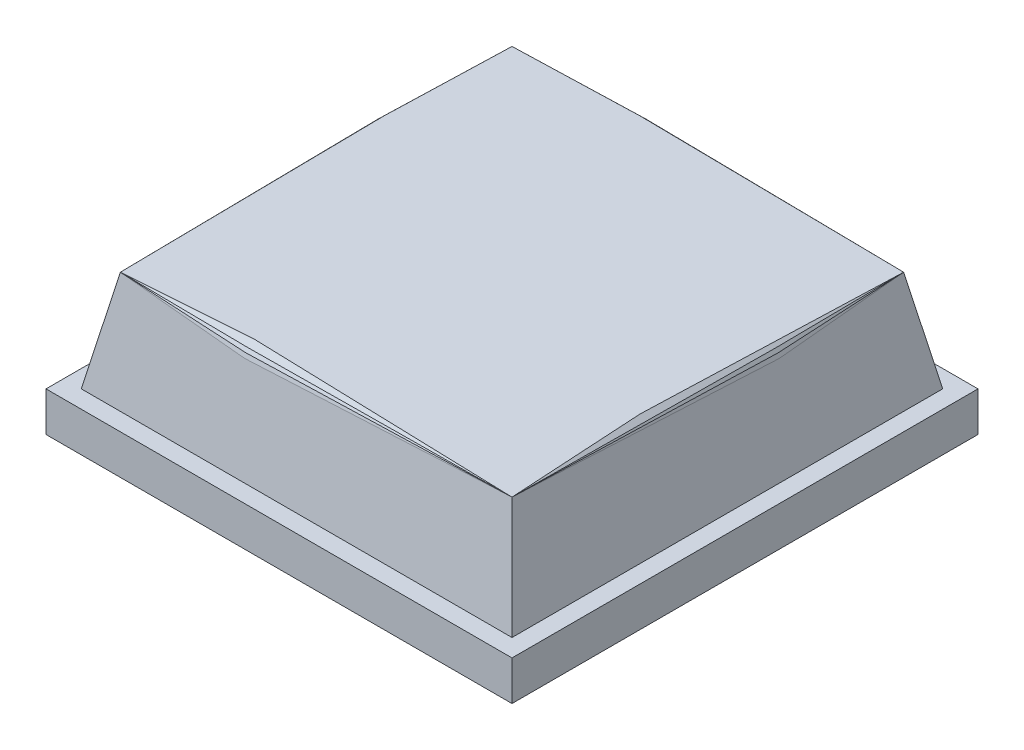
ISO-10303-21;
HEADER;
FILE_DESCRIPTION(('STEP AP214'),'2;1');
FILE_NAME('part.step','',(''),(''),'','','');
FILE_SCHEMA(('AUTOMOTIVE_DESIGN { 1 0 10303 214 1 1 1 1 }'));
ENDSEC;
DATA;
#1=APPLICATION_CONTEXT('core data for automotive mechanical design processes');
#2=APPLICATION_PROTOCOL_DEFINITION('international standard','automotive_design',2000,#1);
#3=PRODUCT_CONTEXT('',#1,'mechanical');
#4=PRODUCT('Part','Part','',(#3));
#5=PRODUCT_RELATED_PRODUCT_CATEGORY('part','',(#4));
#6=PRODUCT_DEFINITION_FORMATION('','',#4);
#7=PRODUCT_DEFINITION_CONTEXT('part definition',#1,'design');
#8=PRODUCT_DEFINITION('design','',#6,#7);
#9=PRODUCT_DEFINITION_SHAPE('','',#8);
#10=(LENGTH_UNIT() NAMED_UNIT(*) SI_UNIT(.MILLI.,.METRE.));
#11=(NAMED_UNIT(*) PLANE_ANGLE_UNIT() SI_UNIT($,.RADIAN.));
#12=(NAMED_UNIT(*) SI_UNIT($,.STERADIAN.) SOLID_ANGLE_UNIT());
#13=UNCERTAINTY_MEASURE_WITH_UNIT(LENGTH_MEASURE(1.E-05),#10,'distance_accuracy_value','');
#14=(GEOMETRIC_REPRESENTATION_CONTEXT(3) GLOBAL_UNCERTAINTY_ASSIGNED_CONTEXT((#13)) GLOBAL_UNIT_ASSIGNED_CONTEXT((#10,
#11,#12)) REPRESENTATION_CONTEXT('',''));
#15=CARTESIAN_POINT('',(0.,0.,0.));
#16=DIRECTION('',(0.,0.,1.));
#17=DIRECTION('',(1.,0.,0.));
#18=AXIS2_PLACEMENT_3D('',#15,#16,#17);
#19=CARTESIAN_POINT('',(-1.322304010391,0.900009989738,-1.322298049927));
#20=DIRECTION('',(0.,-1.,0.));
#21=DIRECTION('',(0.,0.,-1.));
#22=AXIS2_PLACEMENT_3D('',#19,#20,#21);
#23=PLANE('',#22);
#24=DIRECTION('',(1.,0.,0.));
#25=VECTOR('',#24,1.);
#26=CARTESIAN_POINT('',(-1.322304010391,0.900009989738,1.36746145053088));
#27=LINE('',#26,#25);
#28=CARTESIAN_POINT('',(-1.38684975132917,0.855441931824092,1.38679408885828));
#29=VERTEX_POINT('',#28);
#30=CARTESIAN_POINT('',(1.38195648174537,0.858002736950883,1.3819585083034));
#31=VERTEX_POINT('',#30);
#32=EDGE_CURVE('E139',#29,#31,#27,.T.);
#33=ORIENTED_EDGE('',*,*,#32,.T.);
#34=DIRECTION('',(0.,0.,-1.));
#35=VECTOR('',#34,1.);
#36=CARTESIAN_POINT('',(1.36745942397288,0.900009989738,1.322249054909));
#37=LINE('',#36,#35);
#38=CARTESIAN_POINT('',(1.38679205942356,0.855441938343511,-1.38684374729613));
#39=VERTEX_POINT('',#38);
#40=EDGE_CURVE('E143',#31,#39,#37,.T.);
#41=ORIENTED_EDGE('',*,*,#40,.T.);
#42=DIRECTION('',(1.,0.,0.));
#43=VECTOR('',#42,1.);
#44=CARTESIAN_POINT('',(1.322247028351,0.900009989738,-1.36751127495713));
#45=LINE('',#44,#43);
#46=CARTESIAN_POINT('',(-1.38201398596581,0.858002826587039,-1.38200798734529));
#47=VERTEX_POINT('',#46);
#48=EDGE_CURVE('E129',#47,#39,#45,.T.);
#49=ORIENTED_EDGE('',*,*,#48,.F.);
#50=DIRECTION('',(0.,0.,1.));
#51=VECTOR('',#50,1.);
#52=CARTESIAN_POINT('',(-1.36751723542201,0.900009989738,-1.322298049927));
#53=LINE('',#52,#51);
#54=EDGE_CURVE('E126',#47,#29,#53,.T.);
#55=ORIENTED_EDGE('',*,*,#54,.T.);
#56=EDGE_LOOP('',(#33,#41,#49,#55));
#57=FACE_BOUND('',#56,.T.);
#58=ADVANCED_FACE('F17',(#57),#23,.F.);
#59=CARTESIAN_POINT('',(-1.386971950531,0.881332993507,-1.386965990067));
#60=DIRECTION('',(0.692540892128907,-0.721378619539904,0.));
#61=DIRECTION('',(0.721378619539904,0.692540892128907,0.));
#62=AXIS2_PLACEMENT_3D('',#59,#60,#61);
#63=PLANE('',#62);
#64=DIRECTION('',(0.,0.,1.));
#65=VECTOR('',#64,1.);
#66=CARTESIAN_POINT('',(-1.40563499927527,0.863416016102158,0.01156492549872));
#67=LINE('',#66,#65);
#68=EDGE_CURVE('E112',#47,#29,#67,.T.);
#69=ORIENTED_EDGE('',*,*,#68,.T.);
#70=ORIENTED_EDGE('',*,*,#54,.F.);
#71=EDGE_LOOP('',(#69,#70));
#72=FACE_BOUND('',#71,.T.);
#73=ADVANCED_FACE('F124',(#72),#63,.F.);
#74=CARTESIAN_POINT('',(-1.386971950531,0.881332993507,1.386916041374));
#75=DIRECTION('',(0.,-0.72137640958305,-0.692543194102048));
#76=DIRECTION('',(0.,0.692543194102048,-0.72137640958305));
#77=AXIS2_PLACEMENT_3D('',#74,#75,#76);
#78=PLANE('',#77);
#79=DIRECTION('',(1.,0.,0.));
#80=VECTOR('',#79,1.);
#81=CARTESIAN_POINT('',(0.01156094541689,0.863416016101707,1.4055789709085));
#82=LINE('',#81,#80);
#83=EDGE_CURVE('E128',#29,#31,#82,.T.);
#84=ORIENTED_EDGE('',*,*,#83,.T.);
#85=ORIENTED_EDGE('',*,*,#32,.F.);
#86=EDGE_LOOP('',(#84,#85));
#87=FACE_BOUND('',#86,.T.);
#88=ADVANCED_FACE('F140',(#87),#78,.F.);
#89=CARTESIAN_POINT('',(1.400900153844,0.867905876587,0.003254344412202));
#90=DIRECTION('',(0.692543194102048,0.72137640958305,0.));
#91=DIRECTION('',(-0.72137640958305,0.692543194102048,0.));
#92=AXIS2_PLACEMENT_3D('',#89,#90,#91);
#93=PLANE('',#92);
#94=DIRECTION('',(0.,0.,1.));
#95=VECTOR('',#94,1.);
#96=CARTESIAN_POINT('',(1.40557694435103,0.863416016102019,-0.01161496344334));
#97=LINE('',#96,#95);
#98=EDGE_CURVE('E136',#39,#31,#97,.T.);
#99=ORIENTED_EDGE('',*,*,#98,.F.);
#100=ORIENTED_EDGE('',*,*,#40,.F.);
#101=EDGE_LOOP('',(#99,#100));
#102=FACE_BOUND('',#101,.T.);
#103=ADVANCED_FACE('F418',(#102),#93,.T.);
#104=CARTESIAN_POINT('',(0.003250368179617,0.867905876627,-1.400952218388));
#105=DIRECTION('',(0.,0.721378619539904,-0.692540892128907));
#106=DIRECTION('',(0.,0.692540892128907,0.721378619539904));
#107=AXIS2_PLACEMENT_3D('',#104,#105,#106);
#108=PLANE('',#107);
#109=DIRECTION('',(1.,0.,0.));
#110=VECTOR('',#109,1.);
#111=CARTESIAN_POINT('',(-0.01161894362515,0.863416016102001,-1.405629038811));
#112=LINE('',#111,#110);
#113=EDGE_CURVE('E115',#39,#47,#112,.F.);
#114=ORIENTED_EDGE('',*,*,#113,.T.);
#115=ORIENTED_EDGE('',*,*,#48,.T.);
#116=EDGE_LOOP('',(#114,#115));
#117=FACE_BOUND('',#116,.T.);
#118=ADVANCED_FACE('F409',(#117),#108,.T.);
#119=CARTESIAN_POINT('',(-1.405634999275,0.863416016102,-1.405629038811));
#120=DIRECTION('',(0.860384417172621,-0.509645616763776,0.));
#121=DIRECTION('',(0.509645616763776,0.860384417172621,0.));
#122=AXIS2_PLACEMENT_3D('',#119,#120,#121);
#123=PLANE('',#122);
#124=DIRECTION('',(0.,0.,1.));
#125=VECTOR('',#124,1.);
#126=CARTESIAN_POINT('',(-1.4201569557191,0.838900029659029,1.428475022316));
#127=LINE('',#126,#125);
#128=EDGE_CURVE('E98',#47,#29,#127,.T.);
#129=ORIENTED_EDGE('',*,*,#128,.T.);
#130=ORIENTED_EDGE('',*,*,#68,.F.);
#131=EDGE_LOOP('',(#129,#130));
#132=FACE_BOUND('',#131,.T.);
#133=ADVANCED_FACE('F110',(#132),#123,.F.);
#134=CARTESIAN_POINT('',(-1.405634999275,0.863416016102,1.405578970909));
#135=DIRECTION('',(0.,-0.509648713733221,-0.860382582686373));
#136=DIRECTION('',(0.,0.860382582686373,-0.509648713733221));
#137=AXIS2_PLACEMENT_3D('',#134,#135,#136);
#138=PLANE('',#137);
#139=DIRECTION('',(1.,0.,0.));
#140=VECTOR('',#139,1.);
#141=CARTESIAN_POINT('',(0.01010403867814,0.838900029659013,1.42010104656205));
#142=LINE('',#141,#140);
#143=EDGE_CURVE('E114',#31,#29,#142,.F.);
#144=ORIENTED_EDGE('',*,*,#143,.F.);
#145=ORIENTED_EDGE('',*,*,#83,.F.);
#146=EDGE_LOOP('',(#144,#145));
#147=FACE_BOUND('',#146,.T.);
#148=ADVANCED_FACE('F133',(#147),#138,.F.);
#149=CARTESIAN_POINT('',(1.416457285391,0.845047960475,0.004303960654688));
#150=DIRECTION('',(0.860382582686373,0.509648713733221,0.));
#151=DIRECTION('',(-0.509648713733221,0.860382582686373,0.));
#152=AXIS2_PLACEMENT_3D('',#149,#150,#151);
#153=PLANE('',#152);
#154=DIRECTION('',(0.,0.,1.));
#155=VECTOR('',#154,1.);
#156=CARTESIAN_POINT('',(1.42009902000436,0.8389000296591,-1.428524971008));
#157=LINE('',#156,#155);
#158=EDGE_CURVE('E121',#31,#39,#157,.F.);
#159=ORIENTED_EDGE('',*,*,#158,.T.);
#160=ORIENTED_EDGE('',*,*,#98,.T.);
#161=EDGE_LOOP('',(#159,#160));
#162=FACE_BOUND('',#161,.T.);
#163=ADVANCED_FACE('F382',(#162),#153,.T.);
#164=CARTESIAN_POINT('',(0.004299953814113,0.84504796039,-1.416509290586));
#165=DIRECTION('',(0.,-0.509645616763776,0.860384417172621));
#166=DIRECTION('',(0.,-0.860384417172621,-0.509645616763776));
#167=AXIS2_PLACEMENT_3D('',#164,#165,#166);
#168=PLANE('',#167);
#169=DIRECTION('',(1.,0.,0.));
#170=VECTOR('',#169,1.);
#171=CARTESIAN_POINT('',(-0.01016201191649,0.83890002965894,-1.42015099525478));
#172=LINE('',#171,#170);
#173=EDGE_CURVE('E177',#39,#47,#172,.F.);
#174=ORIENTED_EDGE('',*,*,#173,.T.);
#175=ORIENTED_EDGE('',*,*,#113,.F.);
#176=EDGE_LOOP('',(#174,#175));
#177=FACE_BOUND('',#176,.T.);
#178=ADVANCED_FACE('F373',(#177),#168,.F.);
#179=CARTESIAN_POINT('',(-1.420156955719,0.838900029659,-1.420150995255));
#180=DIRECTION('',(0.963369349179908,-0.268178106974974,0.));
#181=DIRECTION('',(0.268178106974974,0.963369349179908,0.));
#182=AXIS2_PLACEMENT_3D('',#179,#180,#181);
#183=PLANE('',#182);
#184=DIRECTION('',(0.,0.,1.));
#185=VECTOR('',#184,1.);
#186=CARTESIAN_POINT('',(-1.42853105068208,0.808817982674011,-0.175717359814));
#187=LINE('',#186,#185);
#188=EDGE_CURVE('E87',#47,#29,#187,.T.);
#189=ORIENTED_EDGE('',*,*,#188,.T.);
#190=ORIENTED_EDGE('',*,*,#128,.F.);
#191=EDGE_LOOP('',(#189,#190));
#192=FACE_BOUND('',#191,.T.);
#193=ADVANCED_FACE('F96',(#192),#183,.F.);
#194=CARTESIAN_POINT('',(-0.005975024037807,0.816370114777,1.426372726181));
#195=DIRECTION('',(0.,0.268174563888085,0.963370335480305));
#196=DIRECTION('',(0.,-0.963370335480305,0.268174563888085));
#197=AXIS2_PLACEMENT_3D('',#194,#195,#196);
#198=PLANE('',#197);
#199=DIRECTION('',(1.,0.,0.));
#200=VECTOR('',#199,1.);
#201=CARTESIAN_POINT('',(-0.175721406951,0.808817982674032,1.42847502231623));
#202=LINE('',#201,#200);
#203=EDGE_CURVE('E92',#29,#31,#202,.T.);
#204=ORIENTED_EDGE('',*,*,#203,.T.);
#205=ORIENTED_EDGE('',*,*,#143,.T.);
#206=EDGE_LOOP('',(#204,#205));
#207=FACE_BOUND('',#206,.T.);
#208=ADVANCED_FACE('F117',(#207),#198,.T.);
#209=CARTESIAN_POINT('',(1.426370699578,0.816370114937,0.005921044253369));
#210=DIRECTION('',(0.963370335480305,0.268174563888085,0.));
#211=DIRECTION('',(-0.268174563888085,0.963370335480305,0.));
#212=AXIS2_PLACEMENT_3D('',#209,#210,#211);
#213=PLANE('',#212);
#214=DIRECTION('',(0.,0.,1.));
#215=VECTOR('',#214,1.);
#216=CARTESIAN_POINT('',(1.42847299575836,0.808817982674051,0.175667414386));
#217=LINE('',#216,#215);
#218=EDGE_CURVE('E160',#31,#39,#217,.F.);
#219=ORIENTED_EDGE('',*,*,#218,.T.);
#220=ORIENTED_EDGE('',*,*,#158,.F.);
#221=EDGE_LOOP('',(#219,#220));
#222=FACE_BOUND('',#221,.T.);
#223=ADVANCED_FACE('F346',(#222),#213,.T.);
#224=CARTESIAN_POINT('',(1.420099020004,0.838900029659,-1.420150995255));
#225=DIRECTION('',(0.,-0.268174563888085,0.963370335480305));
#226=DIRECTION('',(0.,-0.963370335480305,-0.268174563888085));
#227=AXIS2_PLACEMENT_3D('',#224,#225,#226);
#228=PLANE('',#227);
#229=DIRECTION('',(1.,0.,0.));
#230=VECTOR('',#229,1.);
#231=CARTESIAN_POINT('',(0.175663386793,0.80881798267403,-1.42852497100821));
#232=LINE('',#231,#230);
#233=EDGE_CURVE('E173',#39,#47,#232,.F.);
#234=ORIENTED_EDGE('',*,*,#233,.T.);
#235=ORIENTED_EDGE('',*,*,#173,.F.);
#236=EDGE_LOOP('',(#234,#235));
#237=FACE_BOUND('',#236,.T.);
#238=ADVANCED_FACE('F337',(#237),#228,.F.);
#239=CARTESIAN_POINT('',(-1.498535511995,0.323583367551,0.127422398362));
#240=DIRECTION('',(0.989752869050483,-0.14279095982007,0.));
#241=DIRECTION('',(0.14279095982007,0.989752869050483,0.));
#242=AXIS2_PLACEMENT_3D('',#239,#240,#241);
#243=PLANE('',#242);
#244=DIRECTION('',(-0.141357144348653,-0.979814403910171,0.141357318988969));
#245=VECTOR('',#244,1.);
#246=CARTESIAN_POINT('',(-1.42853105068154,0.808817982673934,1.428475022316));
#247=LINE('',#246,#245);
#248=CARTESIAN_POINT('',(-1.52502095699291,0.140000000596016,1.5249650478362));
#249=VERTEX_POINT('',#248);
#250=EDGE_CURVE('E84',#29,#249,#247,.T.);
#251=ORIENTED_EDGE('',*,*,#250,.F.);
#252=ORIENTED_EDGE('',*,*,#188,.F.);
#253=DIRECTION('',(0.141357144348624,0.979814403909969,0.141357318990405));
#254=VECTOR('',#253,1.);
#255=CARTESIAN_POINT('',(-1.52502095699319,0.140000000596028,-1.525014996529));
#256=LINE('',#255,#254);
#257=CARTESIAN_POINT('',(-1.52502095699305,0.140000000595994,-1.52501499652891));
#258=VERTEX_POINT('',#257);
#259=EDGE_CURVE('E100',#258,#47,#256,.T.);
#260=ORIENTED_EDGE('',*,*,#259,.F.);
#261=DIRECTION('',(0.,0.,-1.));
#262=VECTOR('',#261,1.);
#263=CARTESIAN_POINT('',(-1.525020956993,0.140000000596,1.524965047836));
#264=LINE('',#263,#262);
#265=EDGE_CURVE('E90',#258,#249,#264,.F.);
#266=ORIENTED_EDGE('',*,*,#265,.T.);
#267=EDGE_LOOP('',(#251,#252,#260,#266));
#268=FACE_BOUND('',#267,.T.);
#269=ADVANCED_FACE('F86',(#268),#243,.F.);
#270=CARTESIAN_POINT('',(0.127418432887,0.323583346745,1.498479573119));
#271=DIRECTION('',(0.,0.14279113263494,0.989752844118586));
#272=DIRECTION('',(0.,-0.989752844118586,0.14279113263494));
#273=AXIS2_PLACEMENT_3D('',#270,#271,#272);
#274=PLANE('',#273);
#275=DIRECTION('',(-0.141357315499379,0.979814379721809,-0.141357315499324));
#276=VECTOR('',#275,1.);
#277=CARTESIAN_POINT('',(1.52496302127839,0.140000000596057,1.524965047836));
#278=LINE('',#277,#276);
#279=CARTESIAN_POINT('',(1.52496302127812,0.140000000596056,1.52496504783627));
#280=VERTEX_POINT('',#279);
#281=EDGE_CURVE('E78',#280,#31,#278,.T.);
#282=ORIENTED_EDGE('',*,*,#281,.T.);
#283=ORIENTED_EDGE('',*,*,#203,.F.);
#284=ORIENTED_EDGE('',*,*,#250,.T.);
#285=DIRECTION('',(1.,0.,0.));
#286=VECTOR('',#285,1.);
#287=CARTESIAN_POINT('',(1.524963021278,0.140000000596,1.524965047836));
#288=LINE('',#287,#286);
#289=EDGE_CURVE('E168',#249,#280,#288,.T.);
#290=ORIENTED_EDGE('',*,*,#289,.T.);
#291=EDGE_LOOP('',(#282,#283,#284,#290));
#292=FACE_BOUND('',#291,.T.);
#293=ADVANCED_FACE('F103',(#292),#274,.T.);
#294=CARTESIAN_POINT('',(1.498477543493,0.323583368012,-0.127472350318));
#295=DIRECTION('',(-0.989752844118586,-0.14279113263494,0.));
#296=DIRECTION('',(0.14279113263494,-0.989752844118586,0.));
#297=AXIS2_PLACEMENT_3D('',#294,#295,#296);
#298=PLANE('',#297);
#299=DIRECTION('',(0.14135731549935,-0.979814379721606,-0.14135731550076));
#300=VECTOR('',#299,1.);
#301=CARTESIAN_POINT('',(1.42847299575868,0.808817982674098,-1.428524971008));
#302=LINE('',#301,#300);
#303=CARTESIAN_POINT('',(1.52496302127818,0.14000000059596,-1.52501499652854));
#304=VERTEX_POINT('',#303);
#305=EDGE_CURVE('E165',#39,#304,#302,.T.);
#306=ORIENTED_EDGE('',*,*,#305,.F.);
#307=ORIENTED_EDGE('',*,*,#218,.F.);
#308=ORIENTED_EDGE('',*,*,#281,.F.);
#309=DIRECTION('',(0.,0.,-1.));
#310=VECTOR('',#309,1.);
#311=CARTESIAN_POINT('',(1.524963021278,0.140000000596,-1.525014996529));
#312=LINE('',#311,#310);
#313=EDGE_CURVE('E167',#280,#304,#312,.T.);
#314=ORIENTED_EDGE('',*,*,#313,.T.);
#315=EDGE_LOOP('',(#306,#307,#308,#314));
#316=FACE_BOUND('',#315,.T.);
#317=ADVANCED_FACE('F310',(#316),#298,.F.);
#318=CARTESIAN_POINT('',(-0.127476394942,0.323583348961,-1.498529521491));
#319=DIRECTION('',(0.,-0.14279113263494,0.989752844118586));
#320=DIRECTION('',(0.,-0.989752844118586,-0.14279113263494));
#321=AXIS2_PLACEMENT_3D('',#318,#319,#320);
#322=PLANE('',#321);
#323=ORIENTED_EDGE('',*,*,#259,.T.);
#324=ORIENTED_EDGE('',*,*,#233,.F.);
#325=ORIENTED_EDGE('',*,*,#305,.T.);
#326=DIRECTION('',(1.,0.,0.));
#327=VECTOR('',#326,1.);
#328=CARTESIAN_POINT('',(-1.525020956993,0.140000000596,-1.525014996529));
#329=LINE('',#328,#327);
#330=EDGE_CURVE('E209',#304,#258,#329,.F.);
#331=ORIENTED_EDGE('',*,*,#330,.T.);
#332=EDGE_LOOP('',(#323,#324,#325,#331));
#333=FACE_BOUND('',#332,.T.);
#334=ADVANCED_FACE('F300',(#333),#322,.F.);
#335=CARTESIAN_POINT('',(1.649999976158,0.140000000596,-1.649999976158));
#336=DIRECTION('',(0.,-1.,0.));
#337=DIRECTION('',(0.,0.,-1.));
#338=AXIS2_PLACEMENT_3D('',#335,#336,#337);
#339=PLANE('',#338);
#340=ORIENTED_EDGE('',*,*,#265,.F.);
#341=ORIENTED_EDGE('',*,*,#330,.F.);
#342=ORIENTED_EDGE('',*,*,#313,.F.);
#343=ORIENTED_EDGE('',*,*,#289,.F.);
#344=EDGE_LOOP('',(#340,#341,#342,#343));
#345=FACE_BOUND('',#344,.T.);
#346=DIRECTION('',(1.,0.,0.));
#347=VECTOR('',#346,1.);
#348=CARTESIAN_POINT('',(-1.649999976158,0.140000000596,-1.649999976158));
#349=LINE('',#348,#347);
#350=CARTESIAN_POINT('',(1.649999976158,0.140000000596,-1.649999976158));
#351=VERTEX_POINT('',#350);
#352=CARTESIAN_POINT('',(-1.649999976158,0.140000000596,-1.649999976158));
#353=VERTEX_POINT('',#352);
#354=EDGE_CURVE('E228',#351,#353,#349,.F.);
#355=ORIENTED_EDGE('',*,*,#354,.T.);
#356=DIRECTION('',(0.,0.,-1.));
#357=VECTOR('',#356,1.);
#358=CARTESIAN_POINT('',(-1.649999976158,0.140000000596,1.649999976158));
#359=LINE('',#358,#357);
#360=CARTESIAN_POINT('',(-1.649999976158,0.140000000596,1.649999976158));
#361=VERTEX_POINT('',#360);
#362=EDGE_CURVE('E215',#353,#361,#359,.F.);
#363=ORIENTED_EDGE('',*,*,#362,.T.);
#364=DIRECTION('',(-1.,0.,0.));
#365=VECTOR('',#364,1.);
#366=CARTESIAN_POINT('',(1.649999976158,0.140000000596,1.649999976158));
#367=LINE('',#366,#365);
#368=CARTESIAN_POINT('',(1.649999976158,0.140000000596,1.649999976158));
#369=VERTEX_POINT('',#368);
#370=EDGE_CURVE('E218',#361,#369,#367,.F.);
#371=ORIENTED_EDGE('',*,*,#370,.T.);
#372=DIRECTION('',(0.,0.,1.));
#373=VECTOR('',#372,1.);
#374=CARTESIAN_POINT('',(1.649999976158,0.140000000596,-1.649999976158));
#375=LINE('',#374,#373);
#376=EDGE_CURVE('E225',#369,#351,#375,.F.);
#377=ORIENTED_EDGE('',*,*,#376,.T.);
#378=EDGE_LOOP('',(#355,#363,#371,#377));
#379=FACE_BOUND('',#378,.T.);
#380=ADVANCED_FACE('F252',(#345,#379),#339,.F.);
#381=CARTESIAN_POINT('',(-1.649999976158,-0.140000000596,-1.649999976158));
#382=DIRECTION('',(1.,0.,0.));
#383=DIRECTION('',(0.,0.,-1.));
#384=AXIS2_PLACEMENT_3D('',#381,#382,#383);
#385=PLANE('',#384);
#386=DIRECTION('',(0.,1.,0.));
#387=VECTOR('',#386,1.);
#388=CARTESIAN_POINT('',(-1.649999976158,-0.140000000596,1.649999976158));
#389=LINE('',#388,#387);
#390=CARTESIAN_POINT('',(-1.649999976158,-0.140000000596,1.649999976158));
#391=VERTEX_POINT('',#390);
#392=EDGE_CURVE('E220',#361,#391,#389,.F.);
#393=ORIENTED_EDGE('',*,*,#392,.F.);
#394=ORIENTED_EDGE('',*,*,#362,.F.);
#395=DIRECTION('',(0.,1.,0.));
#396=VECTOR('',#395,1.);
#397=CARTESIAN_POINT('',(-1.649999976158,0.140000000596,-1.649999976158));
#398=LINE('',#397,#396);
#399=CARTESIAN_POINT('',(-1.649999976158,-0.140000000596,-1.649999976158));
#400=VERTEX_POINT('',#399);
#401=EDGE_CURVE('E212',#400,#353,#398,.T.);
#402=ORIENTED_EDGE('',*,*,#401,.F.);
#403=DIRECTION('',(0.,0.,1.));
#404=VECTOR('',#403,1.);
#405=CARTESIAN_POINT('',(-1.649999976158,-0.140000000596,1.649999976158));
#406=LINE('',#405,#404);
#407=EDGE_CURVE('E230',#400,#391,#406,.T.);
#408=ORIENTED_EDGE('',*,*,#407,.T.);
#409=EDGE_LOOP('',(#393,#394,#402,#408));
#410=FACE_BOUND('',#409,.T.);
#411=ADVANCED_FACE('F250',(#410),#385,.F.);
#412=CARTESIAN_POINT('',(-1.649999976158,-0.140000000596,1.649999976158));
#413=DIRECTION('',(0.,0.,-1.));
#414=DIRECTION('',(-1.,0.,0.));
#415=AXIS2_PLACEMENT_3D('',#412,#413,#414);
#416=PLANE('',#415);
#417=DIRECTION('',(0.,1.,0.));
#418=VECTOR('',#417,1.);
#419=CARTESIAN_POINT('',(1.649999976158,0.140000000596,1.649999976158));
#420=LINE('',#419,#418);
#421=CARTESIAN_POINT('',(1.649999976158,-0.140000000596,1.649999976158));
#422=VERTEX_POINT('',#421);
#423=EDGE_CURVE('E222',#422,#369,#420,.T.);
#424=ORIENTED_EDGE('',*,*,#423,.T.);
#425=ORIENTED_EDGE('',*,*,#370,.F.);
#426=ORIENTED_EDGE('',*,*,#392,.T.);
#427=DIRECTION('',(1.,0.,0.));
#428=VECTOR('',#427,1.);
#429=CARTESIAN_POINT('',(1.649999976158,-0.140000000596,1.649999976158));
#430=LINE('',#429,#428);
#431=EDGE_CURVE('E233',#391,#422,#430,.T.);
#432=ORIENTED_EDGE('',*,*,#431,.T.);
#433=EDGE_LOOP('',(#424,#425,#426,#432));
#434=FACE_BOUND('',#433,.T.);
#435=ADVANCED_FACE('F254',(#434),#416,.F.);
#436=CARTESIAN_POINT('',(1.649999976158,-0.140000000596,1.649999976158));
#437=DIRECTION('',(-1.,0.,0.));
#438=DIRECTION('',(0.,0.,1.));
#439=AXIS2_PLACEMENT_3D('',#436,#437,#438);
#440=PLANE('',#439);
#441=DIRECTION('',(0.,1.,0.));
#442=VECTOR('',#441,1.);
#443=CARTESIAN_POINT('',(1.649999976158,-0.140000000596,-1.649999976158));
#444=LINE('',#443,#442);
#445=CARTESIAN_POINT('',(1.649999976158,-0.140000000596,-1.649999976158));
#446=VERTEX_POINT('',#445);
#447=EDGE_CURVE('E34',#351,#446,#444,.F.);
#448=ORIENTED_EDGE('',*,*,#447,.F.);
#449=ORIENTED_EDGE('',*,*,#376,.F.);
#450=ORIENTED_EDGE('',*,*,#423,.F.);
#451=DIRECTION('',(0.,0.,1.));
#452=VECTOR('',#451,1.);
#453=CARTESIAN_POINT('',(1.649999976158,-0.140000000596,-1.649999976158));
#454=LINE('',#453,#452);
#455=EDGE_CURVE('E26',#422,#446,#454,.F.);
#456=ORIENTED_EDGE('',*,*,#455,.T.);
#457=EDGE_LOOP('',(#448,#449,#450,#456));
#458=FACE_BOUND('',#457,.T.);
#459=ADVANCED_FACE('F240',(#458),#440,.F.);
#460=CARTESIAN_POINT('',(1.649999976158,-0.140000000596,-1.649999976158));
#461=DIRECTION('',(0.,0.,1.));
#462=DIRECTION('',(1.,0.,0.));
#463=AXIS2_PLACEMENT_3D('',#460,#461,#462);
#464=PLANE('',#463);
#465=ORIENTED_EDGE('',*,*,#401,.T.);
#466=ORIENTED_EDGE('',*,*,#354,.F.);
#467=ORIENTED_EDGE('',*,*,#447,.T.);
#468=DIRECTION('',(1.,0.,0.));
#469=VECTOR('',#468,1.);
#470=CARTESIAN_POINT('',(-1.649999976158,-0.140000000596,-1.649999976158));
#471=LINE('',#470,#469);
#472=EDGE_CURVE('E11',#446,#400,#471,.F.);
#473=ORIENTED_EDGE('',*,*,#472,.T.);
#474=EDGE_LOOP('',(#465,#466,#467,#473));
#475=FACE_BOUND('',#474,.T.);
#476=ADVANCED_FACE('F246',(#475),#464,.F.);
#477=CARTESIAN_POINT('',(-1.649999976158,-0.140000000596,-1.649999976158));
#478=DIRECTION('',(0.,1.,0.));
#479=DIRECTION('',(0.,0.,1.));
#480=AXIS2_PLACEMENT_3D('',#477,#478,#479);
#481=PLANE('',#480);
#482=ORIENTED_EDGE('',*,*,#455,.F.);
#483=ORIENTED_EDGE('',*,*,#431,.F.);
#484=ORIENTED_EDGE('',*,*,#407,.F.);
#485=ORIENTED_EDGE('',*,*,#472,.F.);
#486=EDGE_LOOP('',(#482,#483,#484,#485));
#487=FACE_BOUND('',#486,.T.);
#488=ADVANCED_FACE('F244',(#487),#481,.F.);
#489=CLOSED_SHELL('',(#58,#73,#88,#103,#118,#133,#148,#163,#178,#193,#208,#223,#238,#269,#293,
#317,#334,#380,#411,#435,#459,#476,#488));
#490=MANIFOLD_SOLID_BREP('B1',#489);
#491=ADVANCED_BREP_SHAPE_REPRESENTATION('',(#18,#490),#14);
#492=SHAPE_DEFINITION_REPRESENTATION(#9,#491);
ENDSEC;
END-ISO-10303-21;
